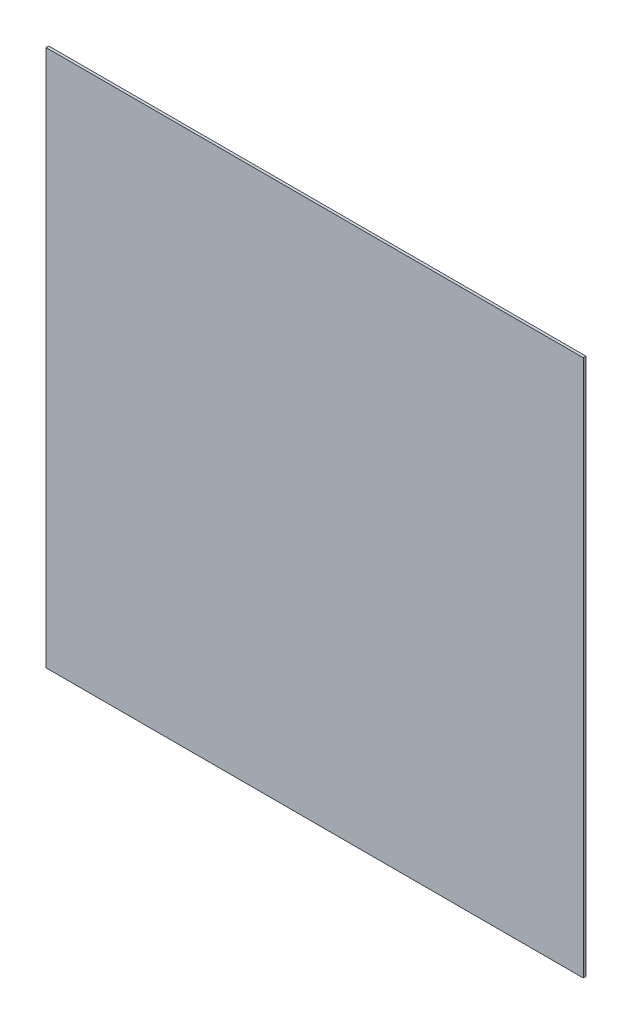
ISO-10303-21;
HEADER;
FILE_DESCRIPTION(('STEP AP214'),'2;1');
FILE_NAME('part.step','',(''),(''),'','','');
FILE_SCHEMA(('AUTOMOTIVE_DESIGN { 1 0 10303 214 1 1 1 1 }'));
ENDSEC;
DATA;
#1=APPLICATION_CONTEXT('core data for automotive mechanical design processes');
#2=APPLICATION_PROTOCOL_DEFINITION('international standard','automotive_design',2000,#1);
#3=PRODUCT_CONTEXT('',#1,'mechanical');
#4=PRODUCT('Part','Part','',(#3));
#5=PRODUCT_RELATED_PRODUCT_CATEGORY('part','',(#4));
#6=PRODUCT_DEFINITION_FORMATION('','',#4);
#7=PRODUCT_DEFINITION_CONTEXT('part definition',#1,'design');
#8=PRODUCT_DEFINITION('design','',#6,#7);
#9=PRODUCT_DEFINITION_SHAPE('','',#8);
#10=(LENGTH_UNIT() NAMED_UNIT(*) SI_UNIT(.MILLI.,.METRE.));
#11=(NAMED_UNIT(*) PLANE_ANGLE_UNIT() SI_UNIT($,.RADIAN.));
#12=(NAMED_UNIT(*) SI_UNIT($,.STERADIAN.) SOLID_ANGLE_UNIT());
#13=UNCERTAINTY_MEASURE_WITH_UNIT(LENGTH_MEASURE(1.E-05),#10,'distance_accuracy_value','');
#14=(GEOMETRIC_REPRESENTATION_CONTEXT(3) GLOBAL_UNCERTAINTY_ASSIGNED_CONTEXT((#13)) GLOBAL_UNIT_ASSIGNED_CONTEXT((#10,
#11,#12)) REPRESENTATION_CONTEXT('',''));
#15=CARTESIAN_POINT('',(0.,0.,0.));
#16=DIRECTION('',(0.,0.,1.));
#17=DIRECTION('',(1.,0.,0.));
#18=AXIS2_PLACEMENT_3D('',#15,#16,#17);
#19=CARTESIAN_POINT('',(0.,0.,3.));
#20=DIRECTION('',(-1.,0.,0.));
#21=DIRECTION('',(0.,0.,1.));
#22=AXIS2_PLACEMENT_3D('',#19,#20,#21);
#23=PLANE('',#22);
#24=DIRECTION('',(0.,1.,0.));
#25=VECTOR('',#24,1.);
#26=CARTESIAN_POINT('',(0.,0.,0.));
#27=LINE('',#26,#25);
#28=CARTESIAN_POINT('',(0.,0.,0.));
#29=VERTEX_POINT('',#28);
#30=CARTESIAN_POINT('',(0.,600.,0.));
#31=VERTEX_POINT('',#30);
#32=EDGE_CURVE('E96',#29,#31,#27,.T.);
#33=ORIENTED_EDGE('',*,*,#32,.T.);
#34=DIRECTION('',(0.,0.,-1.));
#35=VECTOR('',#34,1.);
#36=CARTESIAN_POINT('',(0.,600.,3.));
#37=LINE('',#36,#35);
#38=CARTESIAN_POINT('',(0.,600.,3.));
#39=VERTEX_POINT('',#38);
#40=EDGE_CURVE('E11',#39,#31,#37,.T.);
#41=ORIENTED_EDGE('',*,*,#40,.F.);
#42=DIRECTION('',(0.,1.,0.));
#43=VECTOR('',#42,1.);
#44=CARTESIAN_POINT('',(0.,0.,3.));
#45=LINE('',#44,#43);
#46=CARTESIAN_POINT('',(0.,0.,3.));
#47=VERTEX_POINT('',#46);
#48=EDGE_CURVE('E84',#47,#39,#45,.T.);
#49=ORIENTED_EDGE('',*,*,#48,.F.);
#50=DIRECTION('',(0.,0.,-1.));
#51=VECTOR('',#50,1.);
#52=CARTESIAN_POINT('',(0.,0.,3.));
#53=LINE('',#52,#51);
#54=EDGE_CURVE('E92',#47,#29,#53,.T.);
#55=ORIENTED_EDGE('',*,*,#54,.T.);
#56=EDGE_LOOP('',(#33,#41,#49,#55));
#57=FACE_BOUND('',#56,.T.);
#58=ADVANCED_FACE('F33',(#57),#23,.F.);
#59=CARTESIAN_POINT('',(0.,600.,3.));
#60=DIRECTION('',(0.,-1.,0.));
#61=DIRECTION('',(1.,0.,0.));
#62=AXIS2_PLACEMENT_3D('',#59,#60,#61);
#63=PLANE('',#62);
#64=DIRECTION('',(-1.,0.,0.));
#65=VECTOR('',#64,1.);
#66=CARTESIAN_POINT('',(0.,600.,0.));
#67=LINE('',#66,#65);
#68=CARTESIAN_POINT('',(-600.,600.,0.));
#69=VERTEX_POINT('',#68);
#70=EDGE_CURVE('E88',#31,#69,#67,.T.);
#71=ORIENTED_EDGE('',*,*,#70,.T.);
#72=DIRECTION('',(0.,0.,-1.));
#73=VECTOR('',#72,1.);
#74=CARTESIAN_POINT('',(-600.,600.,3.));
#75=LINE('',#74,#73);
#76=CARTESIAN_POINT('',(-600.,600.,3.));
#77=VERTEX_POINT('',#76);
#78=EDGE_CURVE('E41',#77,#69,#75,.T.);
#79=ORIENTED_EDGE('',*,*,#78,.F.);
#80=DIRECTION('',(-1.,0.,0.));
#81=VECTOR('',#80,1.);
#82=CARTESIAN_POINT('',(0.,600.,3.));
#83=LINE('',#82,#81);
#84=EDGE_CURVE('E79',#39,#77,#83,.T.);
#85=ORIENTED_EDGE('',*,*,#84,.F.);
#86=ORIENTED_EDGE('',*,*,#40,.T.);
#87=EDGE_LOOP('',(#71,#79,#85,#86));
#88=FACE_BOUND('',#87,.T.);
#89=ADVANCED_FACE('F87',(#88),#63,.F.);
#90=CARTESIAN_POINT('',(-600.,0.,3.));
#91=DIRECTION('',(1.,0.,0.));
#92=DIRECTION('',(0.,0.,-1.));
#93=AXIS2_PLACEMENT_3D('',#90,#91,#92);
#94=PLANE('',#93);
#95=DIRECTION('',(0.,-1.,0.));
#96=VECTOR('',#95,1.);
#97=CARTESIAN_POINT('',(-600.,0.,0.));
#98=LINE('',#97,#96);
#99=CARTESIAN_POINT('',(-600.,0.,0.));
#100=VERTEX_POINT('',#99);
#101=EDGE_CURVE('E66',#69,#100,#98,.T.);
#102=ORIENTED_EDGE('',*,*,#101,.T.);
#103=DIRECTION('',(0.,0.,-1.));
#104=VECTOR('',#103,1.);
#105=CARTESIAN_POINT('',(-600.,0.,3.));
#106=LINE('',#105,#104);
#107=CARTESIAN_POINT('',(-600.,0.,3.));
#108=VERTEX_POINT('',#107);
#109=EDGE_CURVE('E89',#108,#100,#106,.T.);
#110=ORIENTED_EDGE('',*,*,#109,.F.);
#111=DIRECTION('',(0.,-1.,0.));
#112=VECTOR('',#111,1.);
#113=CARTESIAN_POINT('',(-600.,0.,3.));
#114=LINE('',#113,#112);
#115=EDGE_CURVE('E82',#77,#108,#114,.T.);
#116=ORIENTED_EDGE('',*,*,#115,.F.);
#117=ORIENTED_EDGE('',*,*,#78,.T.);
#118=EDGE_LOOP('',(#102,#110,#116,#117));
#119=FACE_BOUND('',#118,.T.);
#120=ADVANCED_FACE('F90',(#119),#94,.F.);
#121=CARTESIAN_POINT('',(0.,0.,3.));
#122=DIRECTION('',(0.,1.,0.));
#123=DIRECTION('',(-1.,0.,0.));
#124=AXIS2_PLACEMENT_3D('',#121,#122,#123);
#125=PLANE('',#124);
#126=DIRECTION('',(1.,0.,0.));
#127=VECTOR('',#126,1.);
#128=CARTESIAN_POINT('',(0.,0.,0.));
#129=LINE('',#128,#127);
#130=EDGE_CURVE('E72',#100,#29,#129,.T.);
#131=ORIENTED_EDGE('',*,*,#130,.T.);
#132=ORIENTED_EDGE('',*,*,#54,.F.);
#133=DIRECTION('',(1.,0.,0.));
#134=VECTOR('',#133,1.);
#135=CARTESIAN_POINT('',(0.,0.,3.));
#136=LINE('',#135,#134);
#137=EDGE_CURVE('E49',#108,#47,#136,.T.);
#138=ORIENTED_EDGE('',*,*,#137,.F.);
#139=ORIENTED_EDGE('',*,*,#109,.T.);
#140=EDGE_LOOP('',(#131,#132,#138,#139));
#141=FACE_BOUND('',#140,.T.);
#142=ADVANCED_FACE('F103',(#141),#125,.F.);
#143=CARTESIAN_POINT('',(0.,600.,3.));
#144=DIRECTION('',(0.,0.,1.));
#145=DIRECTION('',(1.,0.,0.));
#146=AXIS2_PLACEMENT_3D('',#143,#144,#145);
#147=PLANE('',#146);
#148=ORIENTED_EDGE('',*,*,#48,.T.);
#149=ORIENTED_EDGE('',*,*,#84,.T.);
#150=ORIENTED_EDGE('',*,*,#115,.T.);
#151=ORIENTED_EDGE('',*,*,#137,.T.);
#152=EDGE_LOOP('',(#148,#149,#150,#151));
#153=FACE_BOUND('',#152,.T.);
#154=ADVANCED_FACE('F80',(#153),#147,.T.);
#155=CARTESIAN_POINT('',(0.,600.,0.));
#156=DIRECTION('',(0.,0.,1.));
#157=DIRECTION('',(1.,0.,0.));
#158=AXIS2_PLACEMENT_3D('',#155,#156,#157);
#159=PLANE('',#158);
#160=ORIENTED_EDGE('',*,*,#32,.F.);
#161=ORIENTED_EDGE('',*,*,#130,.F.);
#162=ORIENTED_EDGE('',*,*,#101,.F.);
#163=ORIENTED_EDGE('',*,*,#70,.F.);
#164=EDGE_LOOP('',(#160,#161,#162,#163));
#165=FACE_BOUND('',#164,.T.);
#166=ADVANCED_FACE('F106',(#165),#159,.F.);
#167=CLOSED_SHELL('',(#58,#89,#120,#142,#154,#166));
#168=MANIFOLD_SOLID_BREP('B2',#167);
#169=ADVANCED_BREP_SHAPE_REPRESENTATION('',(#18,#168),#14);
#170=SHAPE_DEFINITION_REPRESENTATION(#9,#169);
ENDSEC;
END-ISO-10303-21;
